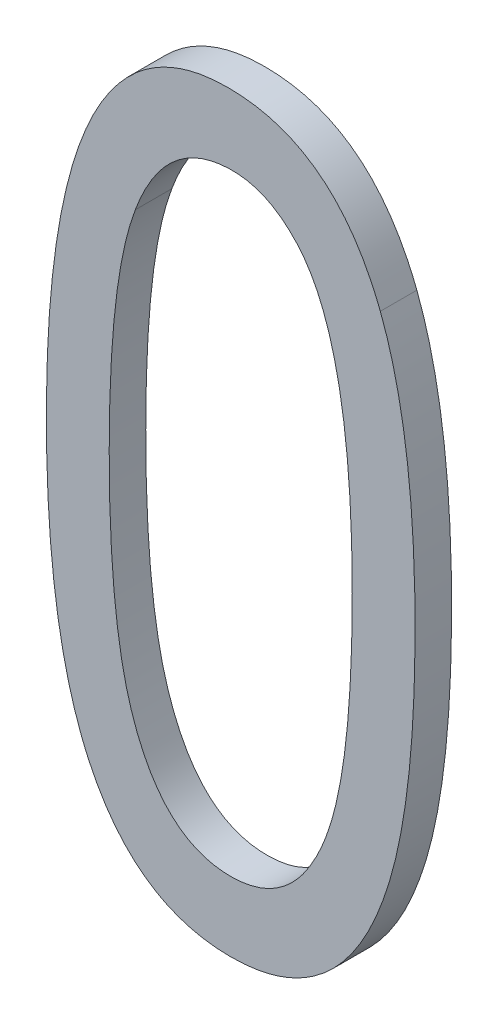
ISO-10303-21;
HEADER;
FILE_DESCRIPTION(('STEP AP214'),'2;1');
FILE_NAME('part.step','',(''),(''),'','','');
FILE_SCHEMA(('AUTOMOTIVE_DESIGN { 1 0 10303 214 1 1 1 1 }'));
ENDSEC;
DATA;
#1=APPLICATION_CONTEXT('core data for automotive mechanical design processes');
#2=APPLICATION_PROTOCOL_DEFINITION('international standard','automotive_design',2000,#1);
#3=PRODUCT_CONTEXT('',#1,'mechanical');
#4=PRODUCT('Part','Part','',(#3));
#5=PRODUCT_RELATED_PRODUCT_CATEGORY('part','',(#4));
#6=PRODUCT_DEFINITION_FORMATION('','',#4);
#7=PRODUCT_DEFINITION_CONTEXT('part definition',#1,'design');
#8=PRODUCT_DEFINITION('design','',#6,#7);
#9=PRODUCT_DEFINITION_SHAPE('','',#8);
#10=(LENGTH_UNIT() NAMED_UNIT(*) SI_UNIT(.MILLI.,.METRE.));
#11=(NAMED_UNIT(*) PLANE_ANGLE_UNIT() SI_UNIT($,.RADIAN.));
#12=(NAMED_UNIT(*) SI_UNIT($,.STERADIAN.) SOLID_ANGLE_UNIT());
#13=UNCERTAINTY_MEASURE_WITH_UNIT(LENGTH_MEASURE(1.E-05),#10,'distance_accuracy_value','');
#14=(GEOMETRIC_REPRESENTATION_CONTEXT(3) GLOBAL_UNCERTAINTY_ASSIGNED_CONTEXT((#13)) GLOBAL_UNIT_ASSIGNED_CONTEXT((#10,
#11,#12)) REPRESENTATION_CONTEXT('',''));
#15=CARTESIAN_POINT('',(0.,0.,0.));
#16=DIRECTION('',(0.,0.,1.));
#17=DIRECTION('',(1.,0.,0.));
#18=AXIS2_PLACEMENT_3D('',#15,#16,#17);
#19=CARTESIAN_POINT('',(178.017928916616,131.090958591415,-38.9997200126349));
#20=DIRECTION('',(0.,0.,-1.));
#21=DIRECTION('',(-1.,0.,0.));
#22=AXIS2_PLACEMENT_3D('',#19,#20,#21);
#23=PLANE('',#22);
#24=CARTESIAN_POINT('',(178.099742593529,130.864264361799,-38.9997200126349));
#25=CARTESIAN_POINT('',(178.093789580297,130.848475242088,-38.9997200126349));
#26=CARTESIAN_POINT('',(178.08852315684,130.832454429874,-38.9997200126349));
#27=CARTESIAN_POINT('',(178.079088888856,130.800117533578,-38.9997200126349));
#28=CARTESIAN_POINT('',(178.074919252059,130.783801978365,-38.9997200126349));
#29=CARTESIAN_POINT('',(178.063624682335,130.73460686473,-38.9997200126349));
#30=CARTESIAN_POINT('',(178.057707016121,130.701457754597,-38.9997200126349));
#31=CARTESIAN_POINT('',(178.046305345,130.623785000683,-38.9997200126349));
#32=CARTESIAN_POINT('',(178.041623235214,130.579152646366,-38.9997200126349));
#33=CARTESIAN_POINT('',(178.034580919529,130.489674358544,-38.9997200126349));
#34=CARTESIAN_POINT('',(178.03222324867,130.444828245335,-38.9997200126349));
#35=CARTESIAN_POINT('',(178.029158189313,130.355024379923,-38.9997200126349));
#36=CARTESIAN_POINT('',(178.02845307034,130.310066558975,-38.9997200126349));
#37=CARTESIAN_POINT('',(178.028241692854,130.219951978565,-38.9997200126349));
#38=CARTESIAN_POINT('',(178.028740700059,130.174795210433,-38.9997200126349));
#39=CARTESIAN_POINT('',(178.031279086931,130.084581394692,-38.9997200126349));
#40=CARTESIAN_POINT('',(178.033316354461,130.039524295235,-38.9997200126349));
#41=CARTESIAN_POINT('',(178.039559584174,129.949595568297,-38.9997200126349));
#42=CARTESIAN_POINT('',(178.043763168341,129.904723791713,-38.9997200126349));
#43=CARTESIAN_POINT('',(178.054199933482,129.825658047955,-38.9997200126349));
#44=CARTESIAN_POINT('',(178.059744386184,129.791380774313,-38.9997200126349));
#45=CARTESIAN_POINT('',(178.07042809382,129.740489065222,-38.9997200126349));
#46=CARTESIAN_POINT('',(178.074378001212,129.723631408122,-38.9997200126349));
#47=CARTESIAN_POINT('',(178.083390155911,129.690216726647,-38.9997200126349));
#48=CARTESIAN_POINT('',(178.088452220159,129.673659653281,-38.9997200126349));
#49=CARTESIAN_POINT('',(178.101853487938,129.634573217558,-38.9997200126349));
#50=CARTESIAN_POINT('',(178.110702566416,129.612214848004,-38.9997200126349));
#51=CARTESIAN_POINT('',(178.131297470756,129.568817174476,-38.9997200126349));
#52=CARTESIAN_POINT('',(178.143040364867,129.547776562361,-38.9997200126349));
#53=CARTESIAN_POINT('',(178.165130846547,129.515886492571,-38.9997200126349));
#54=CARTESIAN_POINT('',(178.174287075146,129.504222752655,-38.9997200126349));
#55=CARTESIAN_POINT('',(178.194242826507,129.48241448985,-38.9997200126349));
#56=CARTESIAN_POINT('',(178.205038122106,129.472266188477,-38.9997200126349));
#57=CARTESIAN_POINT('',(178.228469151742,129.453957194679,-38.9997200126349));
#58=CARTESIAN_POINT('',(178.241127871571,129.445825341317,-38.9997200126349));
#59=CARTESIAN_POINT('',(178.267842018079,129.432320424252,-38.9997200126349));
#60=CARTESIAN_POINT('',(178.281896383116,129.42694528247,-38.9997200126349));
#61=CARTESIAN_POINT('',(178.308504980075,129.419746445154,-38.9997200126349));
#62=CARTESIAN_POINT('',(178.32094831269,129.417497668166,-38.9997200126349));
#63=CARTESIAN_POINT('',(178.346048686785,129.414881213968,-38.9997200126349));
#64=CARTESIAN_POINT('',(178.358706184486,129.414518250076,-38.9997200126349));
#65=CARTESIAN_POINT('',(178.385373559208,129.415602311855,-38.9997200126349));
#66=CARTESIAN_POINT('',(178.399376481428,129.417256156512,-38.9997200126349));
#67=CARTESIAN_POINT('',(178.426815030118,129.42310198542,-38.9997200126349));
#68=CARTESIAN_POINT('',(178.44025242501,129.427285312832,-38.9997200126349));
#69=CARTESIAN_POINT('',(178.465340877674,129.437840719023,-38.9997200126349));
#70=CARTESIAN_POINT('',(178.477049988509,129.444075574264,-38.9997200126349));
#71=CARTESIAN_POINT('',(178.499228407166,129.458467642927,-38.9997200126349));
#72=CARTESIAN_POINT('',(178.509695812353,129.466627750615,-38.9997200126349));
#73=CARTESIAN_POINT('',(178.532582368561,129.487422160129,-38.9997200126349));
#74=CARTESIAN_POINT('',(178.54446824061,129.500637077797,-38.9997200126349));
#75=CARTESIAN_POINT('',(178.566072937179,129.528773580962,-38.9997200126349));
#76=CARTESIAN_POINT('',(178.575781449243,129.543702801898,-38.9997200126349));
#77=CARTESIAN_POINT('',(178.592018384167,129.572180061341,-38.9997200126349));
#78=CARTESIAN_POINT('',(178.598806423218,129.585584456034,-38.9997200126349));
#79=CARTESIAN_POINT('',(178.611227439196,129.612729594924,-38.9997200126349));
#80=CARTESIAN_POINT('',(178.616873181887,129.626464450378,-38.9997200126349));
#81=CARTESIAN_POINT('',(178.622096790767,129.640336357564,-38.9997200126349));
#82=B_SPLINE_CURVE_WITH_KNOTS('',3,(#24,#25,#26,#27,#28,#29,#30,#31,#32,#33,#34,#35,#36,#37,#38,
#39,#40,#41,#42,#43,#44,#45,#46,#47,#48,#49,#50,#51,#52,#53,#54,#55,#56,#57,#58,#59,#60,#61,#62,
#63,#64,#65,#66,#67,#68,#69,#70,#71,#72,#73,#74,#75,#76,#77,#78,#79,#80,#81),.UNSPECIFIED.,.F.,
.F.,(4,2,2,2,2,2,2,2,2,2,2,2,2,2,2,2,2,2,2,2,2,2,2,2,2,2,2,2,4),(0.,0.0505697521013727,
0.101056346901998,0.201963135015351,0.336501437363886,0.471186305792561,0.606056034920357,
0.741516625664493,0.876791557203466,1.01191830958986,1.11598120562329,1.16789468256168,
1.21979962096612,1.29181096162124,1.36374964472859,1.40810546546208,1.45234877662432,
1.49719243924349,1.54200224770691,1.57977700606854,1.6176461316995,1.65974753133217,
1.70170565331121,1.74128991218939,1.7809340622713,1.83395571191186,1.88722341591341,
1.93225019029301,1.97674197173791),.UNSPECIFIED.);
#83=CARTESIAN_POINT('',(178.099742593529,130.864264361799,-38.9997200126349));
#84=VERTEX_POINT('',#83);
#85=CARTESIAN_POINT('',(178.622096790767,129.640336357564,-38.9997200126349));
#86=VERTEX_POINT('',#85);
#87=EDGE_CURVE('E82',#84,#86,#82,.T.);
#88=ORIENTED_EDGE('',*,*,#87,.F.);
#89=CARTESIAN_POINT('',(178.622096790767,129.640336357564,-38.9997200126349));
#90=CARTESIAN_POINT('',(178.628004330679,129.656132944584,-38.9997200126349));
#91=CARTESIAN_POINT('',(178.633238789312,129.672155401784,-38.9997200126349));
#92=CARTESIAN_POINT('',(178.642627417429,129.70448939799,-38.9997200126349));
#93=CARTESIAN_POINT('',(178.646783301055,129.720800433742,-38.9997200126349));
#94=CARTESIAN_POINT('',(178.658052383211,129.769988651637,-38.9997200126349));
#95=CARTESIAN_POINT('',(178.663970804411,129.803132311392,-38.9997200126349));
#96=CARTESIAN_POINT('',(178.675392805247,129.880830542612,-38.9997200126349));
#97=CARTESIAN_POINT('',(178.680095574965,129.925494025505,-38.9997200126349));
#98=CARTESIAN_POINT('',(178.687175099144,130.015036056765,-38.9997200126349));
#99=CARTESIAN_POINT('',(178.689549296494,130.059914787302,-38.9997200126349));
#100=CARTESIAN_POINT('',(178.69265463705,130.149785676277,-38.9997200126349));
#101=CARTESIAN_POINT('',(178.693383474428,130.194777905545,-38.9997200126349));
#102=CARTESIAN_POINT('',(178.693594441821,130.284934462767,-38.9997200126349));
#103=CARTESIAN_POINT('',(178.693071882023,130.330098802803,-38.9997200126349));
#104=CARTESIAN_POINT('',(178.69033528282,130.420316878215,-38.9997200126349));
#105=CARTESIAN_POINT('',(178.688123705049,130.465370678913,-38.9997200126349));
#106=CARTESIAN_POINT('',(178.681422476828,130.55526623786,-38.9997200126349));
#107=CARTESIAN_POINT('',(178.676935681316,130.600108190934,-38.9997200126349));
#108=CARTESIAN_POINT('',(178.666042042627,130.679049407534,-38.9997200126349));
#109=CARTESIAN_POINT('',(178.6603183625,130.713236890861,-38.9997200126349));
#110=CARTESIAN_POINT('',(178.649583947967,130.764062587247,-38.9997200126349));
#111=CARTESIAN_POINT('',(178.645648755054,130.78092493017,-38.9997200126349));
#112=CARTESIAN_POINT('',(178.636886658911,130.814407870121,-38.9997200126349));
#113=CARTESIAN_POINT('',(178.632060155139,130.831028571859,-38.9997200126349));
#114=CARTESIAN_POINT('',(178.619489638825,130.869406441959,-38.9997200126349));
#115=CARTESIAN_POINT('',(178.611309330132,130.891030440105,-38.9997200126349));
#116=CARTESIAN_POINT('',(178.596939273923,130.922480718343,-38.9997200126349));
#117=CARTESIAN_POINT('',(178.591806282151,130.932788799311,-38.9997200126349));
#118=CARTESIAN_POINT('',(178.580700785858,130.952936420333,-38.9997200126349));
#119=CARTESIAN_POINT('',(178.574729298109,130.962776508817,-38.9997200126349));
#120=CARTESIAN_POINT('',(178.563764405771,130.978844704911,-38.9997200126349));
#121=CARTESIAN_POINT('',(178.559035784295,130.985252237368,-38.9997200126349));
#122=CARTESIAN_POINT('',(178.549070900974,130.997659499494,-38.9997200126349));
#123=CARTESIAN_POINT('',(178.543834370338,131.003659010346,-38.9997200126349));
#124=CARTESIAN_POINT('',(178.527521053443,131.021119267774,-38.9997200126349));
#125=CARTESIAN_POINT('',(178.515841281945,131.032040695328,-38.9997200126349));
#126=CARTESIAN_POINT('',(178.493127603276,131.049727698336,-38.9997200126349));
#127=CARTESIAN_POINT('',(178.482405268834,131.056888521978,-38.9997200126349));
#128=CARTESIAN_POINT('',(178.459945231836,131.069305733308,-38.9997200126349));
#129=CARTESIAN_POINT('',(178.448211381583,131.074568982478,-38.9997200126349));
#130=CARTESIAN_POINT('',(178.423923323605,131.082900861981,-38.9997200126349));
#131=CARTESIAN_POINT('',(178.411365931425,131.08596034952,-38.9997200126349));
#132=CARTESIAN_POINT('',(178.392267173485,131.088835338516,-38.9997200126349));
#133=CARTESIAN_POINT('',(178.385842898512,131.089507543054,-38.9997200126349));
#134=CARTESIAN_POINT('',(178.37295891898,131.090279576979,-38.9997200126349));
#135=CARTESIAN_POINT('',(178.366499199154,131.090379136528,-38.9997200126349));
#136=CARTESIAN_POINT('',(178.347681275993,131.090023396089,-38.9997200126349));
#137=CARTESIAN_POINT('',(178.335328633246,131.088977739146,-38.9997200126349));
#138=CARTESIAN_POINT('',(178.31093476444,131.085060073216,-38.9997200126349));
#139=CARTESIAN_POINT('',(178.298892948332,131.08219183763,-38.9997200126349));
#140=CARTESIAN_POINT('',(178.27372096669,131.07397811753,-38.9997200126349));
#141=CARTESIAN_POINT('',(178.260686235486,131.068333691532,-38.9997200126349));
#142=CARTESIAN_POINT('',(178.235898574001,131.054729287914,-38.9997200126349));
#143=CARTESIAN_POINT('',(178.22414588503,131.046768875404,-38.9997200126349));
#144=CARTESIAN_POINT('',(178.200284410746,131.027490389244,-38.9997200126349));
#145=CARTESIAN_POINT('',(178.188454101761,131.015831683925,-38.9997200126349));
#146=CARTESIAN_POINT('',(178.166764165821,130.99073318987,-38.9997200126349));
#147=CARTESIAN_POINT('',(178.156916435369,130.97728340953,-38.9997200126349));
#148=CARTESIAN_POINT('',(178.137948683689,130.94767383249,-38.9997200126349));
#149=CARTESIAN_POINT('',(178.12904317893,130.931380333798,-38.9997200126349));
#150=CARTESIAN_POINT('',(178.113136679815,130.898196417025,-38.9997200126349));
#151=CARTESIAN_POINT('',(178.106107674956,130.881319595501,-38.9997200126349));
#152=CARTESIAN_POINT('',(178.099742593529,130.864264361799,-38.9997200126349));
#153=B_SPLINE_CURVE_WITH_KNOTS('',3,(#89,#90,#91,#92,#93,#94,#95,#96,#97,#98,#99,#100,#101,#102,
#103,#104,#105,#106,#107,#108,#109,#110,#111,#112,#113,#114,#115,#116,#117,#118,#119,#120,#121,
#122,#123,#124,#125,#126,#127,#128,#129,#130,#131,#132,#133,#134,#135,#136,#137,#138,#139,#140,
#141,#142,#143,#144,#145,#146,#147,#148,#149,#150,#151,#152),.UNSPECIFIED.,.F.,.F.,(4,2,2,2,2,2,
2,2,2,2,2,2,2,2,2,2,2,2,2,2,2,2,2,2,2,2,2,2,2,2,2,4),(0.,0.0505451263480618,0.10100942424803,
0.201902267541754,0.336539886851855,0.471325192870312,0.606299271702933,0.741779978745484,
0.877063607287347,1.01217790073848,1.11607361424904,1.16799878628334,1.21990074317902,
1.28909095466446,1.32360838480785,1.35808431440848,1.38194736016653,1.40582310408427,
1.45357840362623,1.49210254296712,1.53048595084576,1.5690276977165,1.58838285091999,
1.60774712377259,1.64481149010122,1.68179936861825,1.72415150207021,1.76651159345748,
1.81606544779546,1.86590832630615,1.92149301694758,1.97619459018601),.UNSPECIFIED.);
#154=EDGE_CURVE('E80',#86,#84,#153,.T.);
#155=ORIENTED_EDGE('',*,*,#154,.F.);
#156=EDGE_LOOP('',(#88,#155));
#157=FACE_BOUND('',#156,.T.);
#158=CARTESIAN_POINT('',(178.770342929953,130.959023493615,-38.9997200126349));
#159=CARTESIAN_POINT('',(178.776383739973,130.943337899789,-38.9997200126349));
#160=CARTESIAN_POINT('',(178.781965480448,130.927484629563,-38.9997200126349));
#161=CARTESIAN_POINT('',(178.792322898546,130.895528883182,-38.9997200126349));
#162=CARTESIAN_POINT('',(178.797099176502,130.879426602482,-38.9997200126349));
#163=CARTESIAN_POINT('',(178.810367962917,130.830956917848,-38.9997200126349));
#164=CARTESIAN_POINT('',(178.817842447056,130.798312063508,-38.9997200126349));
#165=CARTESIAN_POINT('',(178.832918518744,130.721440274453,-38.9997200126349));
#166=CARTESIAN_POINT('',(178.839695444558,130.677057385156,-38.9997200126349));
#167=CARTESIAN_POINT('',(178.850559937959,130.58792176834,-38.9997200126349));
#168=CARTESIAN_POINT('',(178.854643821674,130.543168618663,-38.9997200126349));
#169=CARTESIAN_POINT('',(178.860753484742,130.453478301139,-38.9997200126349));
#170=CARTESIAN_POINT('',(178.862776931202,130.408540982415,-38.9997200126349));
#171=CARTESIAN_POINT('',(178.865217909472,130.31823868764,-38.9997200126349));
#172=CARTESIAN_POINT('',(178.865621391394,130.272873376238,-38.9997200126349));
#173=CARTESIAN_POINT('',(178.865063783104,130.182200324324,-38.9997200126349));
#174=CARTESIAN_POINT('',(178.864104181516,130.136892575012,-38.9997200126349));
#175=CARTESIAN_POINT('',(178.86042279168,130.046367839625,-38.9997200126349));
#176=CARTESIAN_POINT('',(178.857702069792,130.001150815226,-38.9997200126349));
#177=CARTESIAN_POINT('',(178.850949300178,129.922382201833,-38.9997200126349));
#178=CARTESIAN_POINT('',(178.847426593543,129.888787897993,-38.9997200126349));
#179=CARTESIAN_POINT('',(178.838767684882,129.82181056423,-38.9997200126349));
#180=CARTESIAN_POINT('',(178.833631902534,129.788427481655,-38.9997200126349));
#181=CARTESIAN_POINT('',(178.821343966004,129.72227678713,-38.9997200126349));
#182=CARTESIAN_POINT('',(178.814207051765,129.689506446587,-38.9997200126349));
#183=CARTESIAN_POINT('',(178.797156203846,129.624710527528,-38.9997200126349));
#184=CARTESIAN_POINT('',(178.78724537636,129.592684159116,-38.9997200126349));
#185=CARTESIAN_POINT('',(178.766020008948,129.535077142579,-38.9997200126349));
#186=CARTESIAN_POINT('',(178.755214445246,129.509311580616,-38.9997200126349));
#187=CARTESIAN_POINT('',(178.73069433483,129.4590920697,-38.9997200126349));
#188=CARTESIAN_POINT('',(178.716973218722,129.434641241708,-38.9997200126349));
#189=CARTESIAN_POINT('',(178.685777814598,129.387668977202,-38.9997200126349));
#190=CARTESIAN_POINT('',(178.668251006054,129.36518143479,-38.9997200126349));
#191=CARTESIAN_POINT('',(178.629168301156,129.324076248212,-38.9997200126349));
#192=CARTESIAN_POINT('',(178.607630267014,129.305442191969,-38.9997200126349));
#193=CARTESIAN_POINT('',(178.566987812115,129.277732791769,-38.9997200126349));
#194=CARTESIAN_POINT('',(178.548716427189,129.26743201411,-38.9997200126349));
#195=CARTESIAN_POINT('',(178.510662797142,129.2501474644,-38.9997200126349));
#196=CARTESIAN_POINT('',(178.490880362769,129.243164108632,-38.9997200126349));
#197=CARTESIAN_POINT('',(178.450585677218,129.232565499357,-38.9997200126349));
#198=CARTESIAN_POINT('',(178.430078752501,129.22892949367,-38.9997200126349));
#199=CARTESIAN_POINT('',(178.388727760525,129.224560184324,-38.9997200126349));
#200=CARTESIAN_POINT('',(178.367882899491,129.223835176074,-38.9997200126349));
#201=CARTESIAN_POINT('',(178.322367263294,129.225126635684,-38.9997200126349));
#202=CARTESIAN_POINT('',(178.297706823728,129.227678718281,-38.9997200126349));
#203=CARTESIAN_POINT('',(178.249326427406,129.237298330561,-38.9997200126349));
#204=CARTESIAN_POINT('',(178.225603267389,129.244348751809,-38.9997200126349));
#205=CARTESIAN_POINT('',(178.181571104982,129.262500665746,-38.9997200126349));
#206=CARTESIAN_POINT('',(178.161140205607,129.273305776927,-38.9997200126349));
#207=CARTESIAN_POINT('',(178.122649582816,129.29855698438,-38.9997200126349));
#208=CARTESIAN_POINT('',(178.104593282447,129.313008251029,-38.9997200126349));
#209=CARTESIAN_POINT('',(178.068163035866,129.347562151279,-38.9997200126349));
#210=CARTESIAN_POINT('',(178.05031709108,129.368213821031,-38.9997200126349));
#211=CARTESIAN_POINT('',(178.018103496427,129.412100721718,-38.9997200126349));
#212=CARTESIAN_POINT('',(178.003746842245,129.4353437916,-38.9997200126349));
#213=CARTESIAN_POINT('',(177.983350359737,129.473421924732,-38.9997200126349));
#214=CARTESIAN_POINT('',(177.976329131139,129.487750819333,-38.9997200126349));
#215=CARTESIAN_POINT('',(177.963245364639,129.516708809978,-38.9997200126349));
#216=CARTESIAN_POINT('',(177.957175865547,129.531334747628,-38.9997200126349));
#217=CARTESIAN_POINT('',(177.951496454343,129.546106606373,-38.9997200126349));
#218=B_SPLINE_CURVE_WITH_KNOTS('',3,(#158,#159,#160,#161,#162,#163,#164,#165,#166,#167,#168,
#169,#170,#171,#172,#173,#174,#175,#176,#177,#178,#179,#180,#181,#182,#183,#184,#185,#186,#187,
#188,#189,#190,#191,#192,#193,#194,#195,#196,#197,#198,#199,#200,#201,#202,#203,#204,#205,#206,
#207,#208,#209,#210,#211,#212,#213,#214,#215,#216,#217),.UNSPECIFIED.,.F.,.F.,(4,2,2,2,2,2,2,2,
2,2,2,2,2,2,2,2,2,2,2,2,2,2,2,2,2,2,2,2,2,4),(0.,0.0504059167911297,0.100774096965071,
0.201145630119258,0.335720898441056,0.470479875519744,0.605391261949291,0.741470234259192,
0.877400708844989,1.01324895426816,1.1145547233317,1.21583415718673,1.31636230542956,
1.41677833076491,1.50046425327396,1.58434077728174,1.66945814898847,1.75420517810563,
1.81682345639526,1.8794495901967,1.94168480070983,2.0040972362863,2.07813118924435,
2.15188523539914,2.22079670750334,2.28980645318114,2.37123966682029,2.45292626433539,
2.5007696459017,2.54824488311769),.UNSPECIFIED.);
#219=CARTESIAN_POINT('',(178.770342929953,130.959023493615,-38.9997200126349));
#220=VERTEX_POINT('',#219);
#221=CARTESIAN_POINT('',(177.951496454343,129.546106606373,-38.9997200126349));
#222=VERTEX_POINT('',#221);
#223=EDGE_CURVE('E67',#220,#222,#218,.T.);
#224=ORIENTED_EDGE('',*,*,#223,.F.);
#225=CARTESIAN_POINT('',(177.951496454343,129.546106606373,-38.9997200126349));
#226=CARTESIAN_POINT('',(177.945474034493,129.561795160987,-38.9997200126349));
#227=CARTESIAN_POINT('',(177.939908974517,129.577650211671,-38.9997200126349));
#228=CARTESIAN_POINT('',(177.929581309168,129.609607705384,-38.9997200126349));
#229=CARTESIAN_POINT('',(177.924818111387,129.625709956103,-38.9997200126349));
#230=CARTESIAN_POINT('',(177.911579945175,129.674188332918,-38.9997200126349));
#231=CARTESIAN_POINT('',(177.904118436622,129.706839972945,-38.9997200126349));
#232=CARTESIAN_POINT('',(177.88905831944,129.783735601387,-38.9997200126349));
#233=CARTESIAN_POINT('',(177.882281098254,129.828134722178,-38.9997200126349));
#234=CARTESIAN_POINT('',(177.871403544211,129.917301531891,-38.9997200126349));
#235=CARTESIAN_POINT('',(177.867306852366,129.962069638832,-38.9997200126349));
#236=CARTESIAN_POINT('',(177.861170644387,130.051791461034,-38.9997200126349));
#237=CARTESIAN_POINT('',(177.85913351981,130.096745331349,-38.9997200126349));
#238=CARTESIAN_POINT('',(177.856644682673,130.187059318706,-38.9997200126349));
#239=CARTESIAN_POINT('',(177.856206039548,130.232419758082,-38.9997200126349));
#240=CARTESIAN_POINT('',(177.856775973282,130.323081419516,-38.9997200126349));
#241=CARTESIAN_POINT('',(177.857782909591,130.368382650395,-38.9997200126349));
#242=CARTESIAN_POINT('',(177.861656931768,130.458883307037,-38.9997200126349));
#243=CARTESIAN_POINT('',(177.864522757926,130.504082780957,-38.9997200126349));
#244=CARTESIAN_POINT('',(177.871573549321,130.582772903081,-38.9997200126349));
#245=CARTESIAN_POINT('',(177.875235667544,130.61630973198,-38.9997200126349));
#246=CARTESIAN_POINT('',(177.884164395487,130.683192935084,-38.9997200126349));
#247=CARTESIAN_POINT('',(177.889431818133,130.716539204053,-38.9997200126349));
#248=CARTESIAN_POINT('',(177.901924156887,130.782623358916,-38.9997200126349));
#249=CARTESIAN_POINT('',(177.909134728225,130.815363895091,-38.9997200126349));
#250=CARTESIAN_POINT('',(177.926067343046,130.880176210977,-38.9997200126349));
#251=CARTESIAN_POINT('',(177.935786771319,130.912248649708,-38.9997200126349));
#252=CARTESIAN_POINT('',(177.956500194302,130.969686770112,-38.9997200126349));
#253=CARTESIAN_POINT('',(177.966968070338,130.995238656133,-38.9997200126349));
#254=CARTESIAN_POINT('',(177.990716880512,131.045101119168,-38.9997200126349));
#255=CARTESIAN_POINT('',(178.004003601451,131.06940901299,-38.9997200126349));
#256=CARTESIAN_POINT('',(178.03423718281,131.116209985718,-38.9997200126349));
#257=CARTESIAN_POINT('',(178.051235165444,131.13867098759,-38.9997200126349));
#258=CARTESIAN_POINT('',(178.089242078127,131.179869534896,-38.9997200126349));
#259=CARTESIAN_POINT('',(178.110234025597,131.198622183657,-38.9997200126349));
#260=CARTESIAN_POINT('',(178.149625098837,131.226346206265,-38.9997200126349));
#261=CARTESIAN_POINT('',(178.167131335623,131.236588093705,-38.9997200126349));
#262=CARTESIAN_POINT('',(178.203647500228,131.253879556555,-38.9997200126349));
#263=CARTESIAN_POINT('',(178.222656706512,131.260930652977,-38.9997200126349));
#264=CARTESIAN_POINT('',(178.261458176303,131.271769630551,-38.9997200126349));
#265=CARTESIAN_POINT('',(178.281245671755,131.275574879839,-38.9997200126349));
#266=CARTESIAN_POINT('',(178.321192700274,131.280263216907,-38.9997200126349));
#267=CARTESIAN_POINT('',(178.341353173148,131.281137483228,-38.9997200126349));
#268=CARTESIAN_POINT('',(178.384979199733,131.280450944094,-38.9997200126349));
#269=CARTESIAN_POINT('',(178.408439231385,131.278462935197,-38.9997200126349));
#270=CARTESIAN_POINT('',(178.454690600132,131.270679483559,-38.9997200126349));
#271=CARTESIAN_POINT('',(178.4774836122,131.264894621776,-38.9997200126349));
#272=CARTESIAN_POINT('',(178.522634078207,131.248845032742,-38.9997200126349));
#273=CARTESIAN_POINT('',(178.544924742814,131.238388787963,-38.9997200126349));
#274=CARTESIAN_POINT('',(178.587005398151,131.213282781824,-38.9997200126349));
#275=CARTESIAN_POINT('',(178.606793829666,131.198630424126,-38.9997200126349));
#276=CARTESIAN_POINT('',(178.644917208318,131.164661710575,-38.9997200126349));
#277=CARTESIAN_POINT('',(178.662991796877,131.145057595333,-38.9997200126349));
#278=CARTESIAN_POINT('',(178.695786345031,131.103166812801,-38.9997200126349));
#279=CARTESIAN_POINT('',(178.710493863726,131.080870647637,-38.9997200126349));
#280=CARTESIAN_POINT('',(178.732804702228,131.041866957109,-38.9997200126349));
#281=CARTESIAN_POINT('',(178.741191326622,131.025592244302,-38.9997200126349));
#282=CARTESIAN_POINT('',(178.756665289878,130.992612642449,-38.9997200126349));
#283=CARTESIAN_POINT('',(178.763763683187,130.975912968578,-38.9997200126349));
#284=CARTESIAN_POINT('',(178.770342929953,130.959023493615,-38.9997200126349));
#285=B_SPLINE_CURVE_WITH_KNOTS('',3,(#225,#226,#227,#228,#229,#230,#231,#232,#233,#234,#235,
#236,#237,#238,#239,#240,#241,#242,#243,#244,#245,#246,#247,#248,#249,#250,#251,#252,#253,#254,
#255,#256,#257,#258,#259,#260,#261,#262,#263,#264,#265,#266,#267,#268,#269,#270,#271,#272,#273,
#274,#275,#276,#277,#278,#279,#280,#281,#282,#283,#284),.UNSPECIFIED.,.F.,.F.,(4,2,2,2,2,2,2,2,
2,2,2,2,2,2,2,2,2,2,2,2,2,2,2,2,2,2,2,2,2,4),(0.,0.0503945271737126,0.10075165846432,
0.201135330613666,0.335760109523949,0.470567374183789,0.605530997154564,0.74159565902597,
0.877506026763421,1.01332438845358,1.11450339241072,1.21573371874453,1.31623629432947,
1.41663452701319,1.49934715414905,1.58223125397113,1.66633854986945,1.75009590114861,
1.81064867143646,1.8711725464565,1.93137049679814,1.99174946468815,2.06212675165376,
2.13230874124568,2.20567797210259,2.27909269851209,2.35865332061552,2.43850332819713,
2.4933820173032,2.54776487684637),.UNSPECIFIED.);
#286=EDGE_CURVE('E24',#222,#220,#285,.T.);
#287=ORIENTED_EDGE('',*,*,#286,.F.);
#288=EDGE_LOOP('',(#224,#287));
#289=FACE_BOUND('',#288,.T.);
#290=ADVANCED_FACE('F17',(#157,#289),#23,.F.);
#291=CARTESIAN_POINT('',(178.770342929953,130.959023493615,-39.0997200126349));
#292=CARTESIAN_POINT('',(178.770342929953,130.959023493615,-38.9997200126349));
#293=CARTESIAN_POINT('',(178.686905966799,131.173422646606,-39.0997200126349));
#294=CARTESIAN_POINT('',(178.686905966799,131.173422646606,-38.9997200126349));
#295=CARTESIAN_POINT('',(178.547585642275,131.280886913413,-39.0997200126349));
#296=CARTESIAN_POINT('',(178.547585642275,131.280886913413,-38.9997200126349));
#297=CARTESIAN_POINT('',(178.02212681385,131.280886913413,-39.0997200126349));
#298=CARTESIAN_POINT('',(178.02212681385,131.280886913413,-38.9997200126349));
#299=CARTESIAN_POINT('',(177.856417124236,130.938377649253,-39.0997200126349));
#300=CARTESIAN_POINT('',(177.856417124236,130.938377649253,-38.9997200126349));
#301=CARTESIAN_POINT('',(177.856417124236,129.946318358623,-39.0997200126349));
#302=CARTESIAN_POINT('',(177.856417124236,129.946318358623,-38.9997200126349));
#303=CARTESIAN_POINT('',(177.888239593905,129.710743980645,-39.0997200126349));
#304=CARTESIAN_POINT('',(177.888239593905,129.710743980645,-38.9997200126349));
#305=CARTESIAN_POINT('',(177.951496454343,129.546106606373,-39.0997200126349));
#306=CARTESIAN_POINT('',(177.951496454343,129.546106606373,-38.9997200126349));
#307=B_SPLINE_SURFACE_WITH_KNOTS('',3,1,((#291,#292),(#293,#294),(#295,#296),(#297,#298),(#299,
#300),(#301,#302),(#303,#304),(#305,#306)),.UNSPECIFIED.,.F.,.F.,.F.,(4,2,2,4),(2,2),(0.,
0.288697589169659,0.78023260625893,1.),(1.,1.09999999999999),.UNSPECIFIED.);
#308=CARTESIAN_POINT('',(177.951496454343,129.546106606373,-39.0997200126349));
#309=CARTESIAN_POINT('',(177.945474034493,129.561795160987,-39.0997200126349));
#310=CARTESIAN_POINT('',(177.939908974517,129.577650211671,-39.0997200126349));
#311=CARTESIAN_POINT('',(177.929581309168,129.609607705384,-39.0997200126349));
#312=CARTESIAN_POINT('',(177.924818111387,129.625709956103,-39.0997200126349));
#313=CARTESIAN_POINT('',(177.911579945175,129.674188332918,-39.0997200126349));
#314=CARTESIAN_POINT('',(177.904118436622,129.706839972945,-39.0997200126349));
#315=CARTESIAN_POINT('',(177.88905831944,129.783735601387,-39.0997200126349));
#316=CARTESIAN_POINT('',(177.882281098254,129.828134722178,-39.0997200126349));
#317=CARTESIAN_POINT('',(177.871403544211,129.917301531891,-39.0997200126349));
#318=CARTESIAN_POINT('',(177.867306852366,129.962069638832,-39.0997200126349));
#319=CARTESIAN_POINT('',(177.861170644387,130.051791461034,-39.0997200126349));
#320=CARTESIAN_POINT('',(177.85913351981,130.096745331349,-39.0997200126349));
#321=CARTESIAN_POINT('',(177.856644682673,130.187059318706,-39.0997200126349));
#322=CARTESIAN_POINT('',(177.856206039548,130.232419758082,-39.0997200126349));
#323=CARTESIAN_POINT('',(177.856775973282,130.323081419516,-39.0997200126349));
#324=CARTESIAN_POINT('',(177.857782909591,130.368382650395,-39.0997200126349));
#325=CARTESIAN_POINT('',(177.861656931768,130.458883307037,-39.0997200126349));
#326=CARTESIAN_POINT('',(177.864522757926,130.504082780957,-39.0997200126349));
#327=CARTESIAN_POINT('',(177.871573549321,130.582772903081,-39.0997200126349));
#328=CARTESIAN_POINT('',(177.875235667544,130.61630973198,-39.0997200126349));
#329=CARTESIAN_POINT('',(177.884164395487,130.683192935084,-39.0997200126349));
#330=CARTESIAN_POINT('',(177.889431818133,130.716539204053,-39.0997200126349));
#331=CARTESIAN_POINT('',(177.901924156887,130.782623358916,-39.0997200126349));
#332=CARTESIAN_POINT('',(177.909134728225,130.815363895091,-39.0997200126349));
#333=CARTESIAN_POINT('',(177.926067343046,130.880176210977,-39.0997200126349));
#334=CARTESIAN_POINT('',(177.935786771319,130.912248649708,-39.0997200126349));
#335=CARTESIAN_POINT('',(177.956500194302,130.969686770112,-39.0997200126349));
#336=CARTESIAN_POINT('',(177.966968070338,130.995238656133,-39.0997200126349));
#337=CARTESIAN_POINT('',(177.990716880512,131.045101119168,-39.0997200126349));
#338=CARTESIAN_POINT('',(178.004003601451,131.06940901299,-39.0997200126349));
#339=CARTESIAN_POINT('',(178.034237182809,131.116209985718,-39.0997200126349));
#340=CARTESIAN_POINT('',(178.051235165444,131.13867098759,-39.0997200126349));
#341=CARTESIAN_POINT('',(178.089242078127,131.179869534896,-39.0997200126349));
#342=CARTESIAN_POINT('',(178.110234025597,131.198622183657,-39.0997200126349));
#343=CARTESIAN_POINT('',(178.149625098837,131.226346206264,-39.0997200126349));
#344=CARTESIAN_POINT('',(178.167131335623,131.236588093705,-39.0997200126349));
#345=CARTESIAN_POINT('',(178.203647500227,131.253879556555,-39.0997200126349));
#346=CARTESIAN_POINT('',(178.222656706512,131.260930652977,-39.0997200126349));
#347=CARTESIAN_POINT('',(178.261458176303,131.271769630551,-39.0997200126349));
#348=CARTESIAN_POINT('',(178.281245671755,131.275574879839,-39.0997200126349));
#349=CARTESIAN_POINT('',(178.321192700274,131.280263216907,-39.0997200126349));
#350=CARTESIAN_POINT('',(178.341353173148,131.281137483228,-39.0997200126349));
#351=CARTESIAN_POINT('',(178.384979199732,131.280450944094,-39.0997200126349));
#352=CARTESIAN_POINT('',(178.408439231385,131.278462935197,-39.0997200126349));
#353=CARTESIAN_POINT('',(178.454690600132,131.270679483559,-39.0997200126349));
#354=CARTESIAN_POINT('',(178.4774836122,131.264894621776,-39.0997200126349));
#355=CARTESIAN_POINT('',(178.522634078207,131.248845032742,-39.0997200126349));
#356=CARTESIAN_POINT('',(178.544924742814,131.238388787963,-39.0997200126349));
#357=CARTESIAN_POINT('',(178.587005398151,131.213282781825,-39.0997200126349));
#358=CARTESIAN_POINT('',(178.606793829666,131.198630424126,-39.0997200126349));
#359=CARTESIAN_POINT('',(178.644917208318,131.164661710575,-39.0997200126349));
#360=CARTESIAN_POINT('',(178.662991796876,131.145057595333,-39.0997200126349));
#361=CARTESIAN_POINT('',(178.695786345031,131.103166812801,-39.0997200126349));
#362=CARTESIAN_POINT('',(178.710493863725,131.080870647637,-39.0997200126349));
#363=CARTESIAN_POINT('',(178.732804702227,131.04186695711,-39.0997200126349));
#364=CARTESIAN_POINT('',(178.741191326622,131.025592244302,-39.0997200126349));
#365=CARTESIAN_POINT('',(178.756665289878,130.992612642449,-39.0997200126349));
#366=CARTESIAN_POINT('',(178.763763683187,130.975912968578,-39.0997200126349));
#367=CARTESIAN_POINT('',(178.770342929953,130.959023493615,-39.0997200126349));
#368=B_SPLINE_CURVE_WITH_KNOTS('',3,(#308,#309,#310,#311,#312,#313,#314,#315,#316,#317,#318,
#319,#320,#321,#322,#323,#324,#325,#326,#327,#328,#329,#330,#331,#332,#333,#334,#335,#336,#337,
#338,#339,#340,#341,#342,#343,#344,#345,#346,#347,#348,#349,#350,#351,#352,#353,#354,#355,#356,
#357,#358,#359,#360,#361,#362,#363,#364,#365,#366,#367),.UNSPECIFIED.,.F.,.F.,(4,2,2,2,2,2,2,2,
2,2,2,2,2,2,2,2,2,2,2,2,2,2,2,2,2,2,2,2,2,4),(0.,0.0503945271737296,0.100751658464326,
0.201135330613666,0.335760109523945,0.47056737418382,0.605530997154565,0.741595659025971,
0.877506026763423,1.01332438845359,1.11450339241073,1.21573371874454,1.31623629432947,
1.41663452701319,1.499347154149,1.5822312539711,1.66633854986936,1.75009590114853,
1.8106486714363,1.87117254645631,1.93137049679792,1.99174946468785,2.06212675165342,
2.13230874124539,2.20567797210231,2.27909269851175,2.35865332061491,2.43850332819626,
2.49338201730279,2.54776487684636),.UNSPECIFIED.);
#369=CARTESIAN_POINT('',(177.951496454343,129.546106606373,-39.0997200126349));
#370=VERTEX_POINT('',#369);
#371=CARTESIAN_POINT('',(178.770342929953,130.959023493615,-39.0997200126349));
#372=VERTEX_POINT('',#371);
#373=EDGE_CURVE('E111',#370,#372,#368,.T.);
#374=DIRECTION('',(0.,0.,-1.));
#375=VECTOR('',#374,1.);
#376=CARTESIAN_POINT('',(177.951496454343,129.546106606373,-39.0497200126349));
#377=LINE('',#376,#375);
#378=EDGE_CURVE('E71',#222,#370,#377,.T.);
#379=DIRECTION('',(0.,0.,1.));
#380=VECTOR('',#379,1.);
#381=CARTESIAN_POINT('',(178.770342929953,130.959023493615,-39.0497200126349));
#382=LINE('',#381,#380);
#383=EDGE_CURVE('E74',#372,#220,#382,.T.);
#384=ORIENTED_EDGE('',*,*,#373,.F.);
#385=ORIENTED_EDGE('',*,*,#378,.F.);
#386=ORIENTED_EDGE('',*,*,#286,.T.);
#387=ORIENTED_EDGE('',*,*,#383,.F.);
#388=EDGE_LOOP('',(#384,#385,#386,#387));
#389=FACE_BOUND('',#388,.T.);
#390=ADVANCED_FACE('F73',(#389),#307,.T.);
#391=CARTESIAN_POINT('',(177.951496454343,129.546106606373,-39.0997200126349));
#392=CARTESIAN_POINT('',(177.951496454343,129.546106606373,-38.9997200126349));
#393=CARTESIAN_POINT('',(178.034237395386,129.330758402497,-39.0997200126349));
#394=CARTESIAN_POINT('',(178.034237395386,129.330758402497,-38.9997200126349));
#395=CARTESIAN_POINT('',(178.171537189732,129.224243186574,-39.0997200126349));
#396=CARTESIAN_POINT('',(178.171537189732,129.224243186574,-38.9997200126349));
#397=CARTESIAN_POINT('',(178.5658253505,129.224243186574,-39.0997200126349));
#398=CARTESIAN_POINT('',(178.5658253505,129.224243186574,-38.9997200126349));
#399=CARTESIAN_POINT('',(178.709026464007,129.350235775245,-39.0997200126349));
#400=CARTESIAN_POINT('',(178.709026464007,129.350235775245,-38.9997200126349));
#401=CARTESIAN_POINT('',(178.840427883223,129.760432026344,-39.0997200126349));
#402=CARTESIAN_POINT('',(178.840427883223,129.760432026344,-38.9997200126349));
#403=CARTESIAN_POINT('',(178.86542226006,129.977551815478,-39.0997200126349));
#404=CARTESIAN_POINT('',(178.86542226006,129.977551815478,-38.9997200126349));
#405=CARTESIAN_POINT('',(178.86542226006,130.560399883239,-39.0997200126349));
#406=CARTESIAN_POINT('',(178.86542226006,130.560399883239,-38.9997200126349));
#407=CARTESIAN_POINT('',(178.833599790391,130.794915499967,-39.0997200126349));
#408=CARTESIAN_POINT('',(178.833599790391,130.794915499967,-38.9997200126349));
#409=CARTESIAN_POINT('',(178.770342929953,130.959023493615,-39.0997200126349));
#410=CARTESIAN_POINT('',(178.770342929953,130.959023493615,-38.9997200126349));
#411=B_SPLINE_SURFACE_WITH_KNOTS('',3,1,((#391,#392),(#393,#394),(#395,#396),(#397,#398),(#399,
#400),(#401,#402),(#403,#404),(#405,#406),(#407,#408),(#409,#410)),.UNSPECIFIED.,.F.,.F.,.F.,(4,
2,2,2,4),(2,2),(0.,0.283931432389945,0.59234976449322,0.785992882722147,1.),(1.,
1.09999999999999),.UNSPECIFIED.);
#412=CARTESIAN_POINT('',(178.770342929953,130.959023493615,-39.0997200126349));
#413=CARTESIAN_POINT('',(178.776383739973,130.943337899789,-39.0997200126349));
#414=CARTESIAN_POINT('',(178.781965480448,130.927484629563,-39.0997200126349));
#415=CARTESIAN_POINT('',(178.792322898546,130.895528883182,-39.0997200126349));
#416=CARTESIAN_POINT('',(178.797099176502,130.879426602482,-39.0997200126349));
#417=CARTESIAN_POINT('',(178.810367962917,130.830956917848,-39.0997200126349));
#418=CARTESIAN_POINT('',(178.817842447056,130.798312063508,-39.0997200126349));
#419=CARTESIAN_POINT('',(178.832918518744,130.721440274453,-39.0997200126349));
#420=CARTESIAN_POINT('',(178.839695444558,130.677057385156,-39.0997200126349));
#421=CARTESIAN_POINT('',(178.850559937959,130.58792176834,-39.0997200126349));
#422=CARTESIAN_POINT('',(178.854643821674,130.543168618663,-39.0997200126349));
#423=CARTESIAN_POINT('',(178.860753484742,130.453478301139,-39.0997200126349));
#424=CARTESIAN_POINT('',(178.862776931202,130.408540982415,-39.0997200126349));
#425=CARTESIAN_POINT('',(178.865217909472,130.31823868764,-39.0997200126349));
#426=CARTESIAN_POINT('',(178.865621391394,130.272873376238,-39.0997200126349));
#427=CARTESIAN_POINT('',(178.865063783104,130.182200324324,-39.0997200126349));
#428=CARTESIAN_POINT('',(178.864104181516,130.136892575012,-39.0997200126349));
#429=CARTESIAN_POINT('',(178.86042279168,130.046367839625,-39.0997200126349));
#430=CARTESIAN_POINT('',(178.857702069792,130.001150815226,-39.0997200126349));
#431=CARTESIAN_POINT('',(178.850949300178,129.922382201833,-39.0997200126349));
#432=CARTESIAN_POINT('',(178.847426593543,129.888787897993,-39.0997200126349));
#433=CARTESIAN_POINT('',(178.838767684882,129.82181056423,-39.0997200126349));
#434=CARTESIAN_POINT('',(178.833631902534,129.788427481655,-39.0997200126349));
#435=CARTESIAN_POINT('',(178.821343966004,129.72227678713,-39.0997200126349));
#436=CARTESIAN_POINT('',(178.814207051765,129.689506446587,-39.0997200126349));
#437=CARTESIAN_POINT('',(178.797156203846,129.624710527528,-39.0997200126349));
#438=CARTESIAN_POINT('',(178.78724537636,129.592684159116,-39.0997200126349));
#439=CARTESIAN_POINT('',(178.766020008948,129.535077142579,-39.0997200126349));
#440=CARTESIAN_POINT('',(178.755214445246,129.509311580616,-39.0997200126349));
#441=CARTESIAN_POINT('',(178.73069433483,129.4590920697,-39.0997200126349));
#442=CARTESIAN_POINT('',(178.716973218722,129.434641241708,-39.0997200126349));
#443=CARTESIAN_POINT('',(178.685777814598,129.387668977202,-39.0997200126349));
#444=CARTESIAN_POINT('',(178.668251006054,129.36518143479,-39.0997200126349));
#445=CARTESIAN_POINT('',(178.629168301156,129.324076248212,-39.0997200126349));
#446=CARTESIAN_POINT('',(178.607630267014,129.305442191969,-39.0997200126349));
#447=CARTESIAN_POINT('',(178.566987812115,129.277732791769,-39.0997200126349));
#448=CARTESIAN_POINT('',(178.548716427189,129.26743201411,-39.0997200126349));
#449=CARTESIAN_POINT('',(178.510662797142,129.2501474644,-39.0997200126349));
#450=CARTESIAN_POINT('',(178.490880362769,129.243164108632,-39.0997200126349));
#451=CARTESIAN_POINT('',(178.450585677218,129.232565499357,-39.0997200126349));
#452=CARTESIAN_POINT('',(178.430078752501,129.22892949367,-39.0997200126349));
#453=CARTESIAN_POINT('',(178.388727760525,129.224560184324,-39.0997200126349));
#454=CARTESIAN_POINT('',(178.367882899491,129.223835176074,-39.0997200126349));
#455=CARTESIAN_POINT('',(178.322367263294,129.225126635684,-39.0997200126349));
#456=CARTESIAN_POINT('',(178.297706823728,129.227678718281,-39.0997200126349));
#457=CARTESIAN_POINT('',(178.249326427406,129.237298330561,-39.0997200126349));
#458=CARTESIAN_POINT('',(178.225603267389,129.244348751809,-39.0997200126349));
#459=CARTESIAN_POINT('',(178.181571104982,129.262500665746,-39.0997200126349));
#460=CARTESIAN_POINT('',(178.161140205607,129.273305776927,-39.0997200126349));
#461=CARTESIAN_POINT('',(178.122649582816,129.29855698438,-39.0997200126349));
#462=CARTESIAN_POINT('',(178.104593282447,129.313008251029,-39.0997200126349));
#463=CARTESIAN_POINT('',(178.068163035866,129.347562151279,-39.0997200126349));
#464=CARTESIAN_POINT('',(178.05031709108,129.368213821031,-39.0997200126349));
#465=CARTESIAN_POINT('',(178.018103496427,129.412100721718,-39.0997200126349));
#466=CARTESIAN_POINT('',(178.003746842245,129.435343791599,-39.0997200126349));
#467=CARTESIAN_POINT('',(177.983350359737,129.473421924732,-39.0997200126349));
#468=CARTESIAN_POINT('',(177.976329131139,129.487750819333,-39.0997200126349));
#469=CARTESIAN_POINT('',(177.963245364639,129.516708809978,-39.0997200126349));
#470=CARTESIAN_POINT('',(177.957175865547,129.531334747628,-39.0997200126349));
#471=CARTESIAN_POINT('',(177.951496454343,129.546106606373,-39.0997200126349));
#472=B_SPLINE_CURVE_WITH_KNOTS('',3,(#412,#413,#414,#415,#416,#417,#418,#419,#420,#421,#422,
#423,#424,#425,#426,#427,#428,#429,#430,#431,#432,#433,#434,#435,#436,#437,#438,#439,#440,#441,
#442,#443,#444,#445,#446,#447,#448,#449,#450,#451,#452,#453,#454,#455,#456,#457,#458,#459,#460,
#461,#462,#463,#464,#465,#466,#467,#468,#469,#470,#471),.UNSPECIFIED.,.F.,.F.,(4,2,2,2,2,2,2,2,
2,2,2,2,2,2,2,2,2,2,2,2,2,2,2,2,2,2,2,2,2,4),(0.,0.0504059167911559,0.100774096965052,
0.20114563011926,0.335720898441049,0.470479875519737,0.605391261949288,0.741470234259188,
0.877400708844983,1.01324895426815,1.11455472333169,1.21583415718673,1.31636230542957,
1.4167783307649,1.50046425327395,1.58434077728173,1.66945814898847,1.75420517810563,
1.81682345639527,1.87944959019669,1.94168480070983,2.0040972362863,2.07813118924434,
2.15188523539914,2.22079670750333,2.28980645318109,2.37123966682018,2.45292626433524,
2.50076964590163,2.54824488311769),.UNSPECIFIED.);
#473=EDGE_CURVE('E78',#372,#370,#472,.T.);
#474=ORIENTED_EDGE('',*,*,#473,.F.);
#475=ORIENTED_EDGE('',*,*,#383,.T.);
#476=ORIENTED_EDGE('',*,*,#223,.T.);
#477=ORIENTED_EDGE('',*,*,#378,.T.);
#478=EDGE_LOOP('',(#474,#475,#476,#477));
#479=FACE_BOUND('',#478,.T.);
#480=ADVANCED_FACE('F76',(#479),#411,.T.);
#481=CARTESIAN_POINT('',(178.099742593529,130.864264361799,-39.0997200126349));
#482=CARTESIAN_POINT('',(178.099742593529,130.864264361799,-38.9997200126349));
#483=CARTESIAN_POINT('',(178.155625954898,131.014608459205,-39.0997200126349));
#484=CARTESIAN_POINT('',(178.155625954898,131.014608459205,-38.9997200126349));
#485=CARTESIAN_POINT('',(178.244107943732,131.090309888533,-39.0997200126349));
#486=CARTESIAN_POINT('',(178.244107943732,131.090309888533,-38.9997200126349));
#487=CARTESIAN_POINT('',(178.435818919538,131.090309888533,-39.0997200126349));
#488=CARTESIAN_POINT('',(178.435818919538,131.090309888533,-38.9997200126349));
#489=CARTESIAN_POINT('',(178.497911543281,131.058547051052,-39.0997200126349));
#490=CARTESIAN_POINT('',(178.497911543281,131.058547051052,-38.9997200126349));
#491=CARTESIAN_POINT('',(178.64557260644,130.882299919591,-39.0997200126349));
#492=CARTESIAN_POINT('',(178.64557260644,130.882299919591,-38.9997200126349));
#493=CARTESIAN_POINT('',(178.693503308071,130.634513170693,-39.0997200126349));
#494=CARTESIAN_POINT('',(178.693503308071,130.634513170693,-38.9997200126349));
#495=CARTESIAN_POINT('',(178.693503308071,129.971199247982,-39.0997200126349));
#496=CARTESIAN_POINT('',(178.693503308071,129.971199247982,-38.9997200126349));
#497=CARTESIAN_POINT('',(178.669830495269,129.767387707484,-39.0997200126349));
#498=CARTESIAN_POINT('',(178.669830495269,129.767387707484,-38.9997200126349));
#499=CARTESIAN_POINT('',(178.622096790767,129.640336357564,-39.0997200126349));
#500=CARTESIAN_POINT('',(178.622096790767,129.640336357564,-38.9997200126349));
#501=B_SPLINE_SURFACE_WITH_KNOTS('',3,1,((#481,#482),(#483,#484),(#485,#486),(#487,#488),(#489,
#490),(#491,#492),(#493,#494),(#495,#496),(#497,#498),(#499,#500)),.UNSPECIFIED.,.F.,.F.,.F.,(4,
2,2,2,4),(2,2),(0.,0.295863483883634,0.466953869132631,0.774529569545325,1.),(1.,
1.09999999999999),.UNSPECIFIED.);
#502=CARTESIAN_POINT('',(178.622096790767,129.640336357564,-39.0997200126349));
#503=CARTESIAN_POINT('',(178.628004330679,129.656132944584,-39.0997200126349));
#504=CARTESIAN_POINT('',(178.633238789312,129.672155401784,-39.0997200126349));
#505=CARTESIAN_POINT('',(178.642627417429,129.70448939799,-39.0997200126349));
#506=CARTESIAN_POINT('',(178.646783301055,129.720800433742,-39.0997200126349));
#507=CARTESIAN_POINT('',(178.658052383211,129.769988651637,-39.0997200126349));
#508=CARTESIAN_POINT('',(178.663970804411,129.803132311392,-39.0997200126349));
#509=CARTESIAN_POINT('',(178.675392805247,129.880830542612,-39.0997200126349));
#510=CARTESIAN_POINT('',(178.680095574965,129.925494025505,-39.0997200126349));
#511=CARTESIAN_POINT('',(178.687175099145,130.015036056765,-39.0997200126349));
#512=CARTESIAN_POINT('',(178.689549296494,130.059914787302,-39.0997200126349));
#513=CARTESIAN_POINT('',(178.69265463705,130.149785676277,-39.0997200126349));
#514=CARTESIAN_POINT('',(178.693383474428,130.194777905545,-39.0997200126349));
#515=CARTESIAN_POINT('',(178.693594441821,130.284934462767,-39.0997200126349));
#516=CARTESIAN_POINT('',(178.693071882023,130.330098802803,-39.0997200126349));
#517=CARTESIAN_POINT('',(178.69033528282,130.420316878215,-39.0997200126349));
#518=CARTESIAN_POINT('',(178.688123705049,130.465370678913,-39.0997200126349));
#519=CARTESIAN_POINT('',(178.681422476828,130.55526623786,-39.0997200126349));
#520=CARTESIAN_POINT('',(178.676935681316,130.600108190934,-39.0997200126349));
#521=CARTESIAN_POINT('',(178.666042042627,130.679049407534,-39.0997200126349));
#522=CARTESIAN_POINT('',(178.6603183625,130.713236890861,-39.0997200126349));
#523=CARTESIAN_POINT('',(178.649583947967,130.764062587247,-39.0997200126349));
#524=CARTESIAN_POINT('',(178.645648755055,130.78092493017,-39.0997200126349));
#525=CARTESIAN_POINT('',(178.636886658911,130.81440787012,-39.0997200126349));
#526=CARTESIAN_POINT('',(178.63206015514,130.831028571859,-39.0997200126349));
#527=CARTESIAN_POINT('',(178.619489638825,130.869406441959,-39.0997200126349));
#528=CARTESIAN_POINT('',(178.611309330132,130.891030440105,-39.0997200126349));
#529=CARTESIAN_POINT('',(178.596939273923,130.922480718343,-39.0997200126349));
#530=CARTESIAN_POINT('',(178.591806282151,130.932788799311,-39.0997200126349));
#531=CARTESIAN_POINT('',(178.580700785858,130.952936420333,-39.0997200126349));
#532=CARTESIAN_POINT('',(178.574729298109,130.962776508817,-39.0997200126349));
#533=CARTESIAN_POINT('',(178.563764405771,130.978844704911,-39.0997200126349));
#534=CARTESIAN_POINT('',(178.559035784295,130.985252237368,-39.0997200126349));
#535=CARTESIAN_POINT('',(178.549070900974,130.997659499494,-39.0997200126349));
#536=CARTESIAN_POINT('',(178.543834370338,131.003659010346,-39.0997200126349));
#537=CARTESIAN_POINT('',(178.527521053443,131.021119267774,-39.0997200126349));
#538=CARTESIAN_POINT('',(178.515841281945,131.032040695328,-39.0997200126349));
#539=CARTESIAN_POINT('',(178.493127603276,131.049727698336,-39.0997200126349));
#540=CARTESIAN_POINT('',(178.482405268834,131.056888521978,-39.0997200126349));
#541=CARTESIAN_POINT('',(178.459945231836,131.069305733308,-39.0997200126349));
#542=CARTESIAN_POINT('',(178.448211381583,131.074568982478,-39.0997200126349));
#543=CARTESIAN_POINT('',(178.423923323605,131.082900861981,-39.0997200126349));
#544=CARTESIAN_POINT('',(178.411365931425,131.08596034952,-39.0997200126349));
#545=CARTESIAN_POINT('',(178.392267173485,131.088835338516,-39.0997200126349));
#546=CARTESIAN_POINT('',(178.385842898512,131.089507543054,-39.0997200126349));
#547=CARTESIAN_POINT('',(178.37295891898,131.090279576979,-39.0997200126349));
#548=CARTESIAN_POINT('',(178.366499199154,131.090379136528,-39.0997200126349));
#549=CARTESIAN_POINT('',(178.347681275993,131.090023396089,-39.0997200126349));
#550=CARTESIAN_POINT('',(178.335328633246,131.088977739146,-39.0997200126349));
#551=CARTESIAN_POINT('',(178.31093476444,131.085060073216,-39.0997200126349));
#552=CARTESIAN_POINT('',(178.298892948332,131.08219183763,-39.0997200126349));
#553=CARTESIAN_POINT('',(178.27372096669,131.07397811753,-39.0997200126349));
#554=CARTESIAN_POINT('',(178.260686235486,131.068333691532,-39.0997200126349));
#555=CARTESIAN_POINT('',(178.235898574001,131.054729287914,-39.0997200126349));
#556=CARTESIAN_POINT('',(178.22414588503,131.046768875404,-39.0997200126349));
#557=CARTESIAN_POINT('',(178.200284410746,131.027490389244,-39.0997200126349));
#558=CARTESIAN_POINT('',(178.188454101761,131.015831683925,-39.0997200126349));
#559=CARTESIAN_POINT('',(178.166764165821,130.990733189871,-39.0997200126349));
#560=CARTESIAN_POINT('',(178.156916435369,130.97728340953,-39.0997200126349));
#561=CARTESIAN_POINT('',(178.137948683689,130.94767383249,-39.0997200126349));
#562=CARTESIAN_POINT('',(178.12904317893,130.931380333798,-39.0997200126349));
#563=CARTESIAN_POINT('',(178.113136679815,130.898196417025,-39.0997200126349));
#564=CARTESIAN_POINT('',(178.106107674956,130.881319595501,-39.0997200126349));
#565=CARTESIAN_POINT('',(178.099742593529,130.864264361799,-39.0997200126349));
#566=B_SPLINE_CURVE_WITH_KNOTS('',3,(#502,#503,#504,#505,#506,#507,#508,#509,#510,#511,#512,
#513,#514,#515,#516,#517,#518,#519,#520,#521,#522,#523,#524,#525,#526,#527,#528,#529,#530,#531,
#532,#533,#534,#535,#536,#537,#538,#539,#540,#541,#542,#543,#544,#545,#546,#547,#548,#549,#550,
#551,#552,#553,#554,#555,#556,#557,#558,#559,#560,#561,#562,#563,#564,#565),.UNSPECIFIED.,.F.,
.F.,(4,2,2,2,2,2,2,2,2,2,2,2,2,2,2,2,2,2,2,2,2,2,2,2,2,2,2,2,2,2,2,4),(0.,0.0505451263480618,
0.10100942424803,0.201902267541754,0.336539886851861,0.471325192870315,0.606299271702936,
0.741779978745488,0.877063607287351,1.01217790073849,1.11607361424891,1.16799878628321,
1.21990074317887,1.28909095466442,1.32360838480793,1.35808431440855,1.38194736016655,
1.40582310408425,1.45357840362617,1.4921025429671,1.53048595084575,1.56902769771649,
1.58838285091993,1.60774712377253,1.64481149010116,1.68179936861822,1.72415150207024,
1.76651159345748,1.81606544779542,1.86590832630606,1.92149301694755,1.97619459018598),.UNSPECIFIED.);
#567=CARTESIAN_POINT('',(178.622096790767,129.640336357564,-39.0997200126349));
#568=VERTEX_POINT('',#567);
#569=CARTESIAN_POINT('',(178.099742593529,130.864264361799,-39.0997200126349));
#570=VERTEX_POINT('',#569);
#571=EDGE_CURVE('E36',#568,#570,#566,.T.);
#572=DIRECTION('',(0.,0.,-1.));
#573=VECTOR('',#572,1.);
#574=CARTESIAN_POINT('',(178.622096790767,129.640336357564,-39.0497200126349));
#575=LINE('',#574,#573);
#576=EDGE_CURVE('E168',#86,#568,#575,.T.);
#577=DIRECTION('',(0.,0.,1.));
#578=VECTOR('',#577,1.);
#579=CARTESIAN_POINT('',(178.099742593529,130.864264361799,-39.0497200126349));
#580=LINE('',#579,#578);
#581=EDGE_CURVE('E45',#570,#84,#580,.T.);
#582=ORIENTED_EDGE('',*,*,#571,.F.);
#583=ORIENTED_EDGE('',*,*,#576,.F.);
#584=ORIENTED_EDGE('',*,*,#154,.T.);
#585=ORIENTED_EDGE('',*,*,#581,.F.);
#586=EDGE_LOOP('',(#582,#583,#584,#585));
#587=FACE_BOUND('',#586,.T.);
#588=ADVANCED_FACE('F135',(#587),#501,.T.);
#589=CARTESIAN_POINT('',(178.622096790767,129.640336357564,-39.0997200126349));
#590=CARTESIAN_POINT('',(178.622096790767,129.640336357564,-38.9997200126349));
#591=CARTESIAN_POINT('',(178.565685964005,129.490189375154,-39.0997200126349));
#592=CARTESIAN_POINT('',(178.565685964005,129.490189375154,-38.9997200126349));
#593=CARTESIAN_POINT('',(178.479283756158,129.414820211455,-39.0997200126349));
#594=CARTESIAN_POINT('',(178.479283756158,129.414820211455,-38.9997200126349));
#595=CARTESIAN_POINT('',(178.232077497881,129.414820211455,-39.0997200126349));
#596=CARTESIAN_POINT('',(178.232077497881,129.414820211455,-38.9997200126349));
#597=CARTESIAN_POINT('',(178.140878956759,129.503756156399,-39.0997200126349));
#598=CARTESIAN_POINT('',(178.140878956759,129.503756156399,-38.9997200126349));
#599=CARTESIAN_POINT('',(178.04802480844,129.805591080551,-39.0997200126349));
#600=CARTESIAN_POINT('',(178.04802480844,129.805591080551,-38.9997200126349));
#601=CARTESIAN_POINT('',(178.028336076225,129.996609517966,-39.0997200126349));
#602=CARTESIAN_POINT('',(178.028336076225,129.996609517966,-38.9997200126349));
#603=CARTESIAN_POINT('',(178.028336076225,130.534989613255,-39.0997200126349));
#604=CARTESIAN_POINT('',(178.028336076225,130.534989613255,-38.9997200126349));
#605=CARTESIAN_POINT('',(178.052008889027,130.738271773128,-39.0997200126349));
#606=CARTESIAN_POINT('',(178.052008889027,130.738271773128,-38.9997200126349));
#607=CARTESIAN_POINT('',(178.099742593529,130.864264361799,-39.0997200126349));
#608=CARTESIAN_POINT('',(178.099742593529,130.864264361799,-38.9997200126349));
#609=B_SPLINE_SURFACE_WITH_KNOTS('',3,1,((#589,#590),(#591,#592),(#593,#594),(#595,#596),(#597,
#598),(#599,#600),(#601,#602),(#603,#604),(#605,#606),(#607,#608)),.UNSPECIFIED.,.F.,.F.,.F.,(4,
2,2,2,4),(2,2),(0.,0.273524125340198,0.569394992946716,0.775594244111861,1.),(1.,
1.09999999999999),.UNSPECIFIED.);
#610=CARTESIAN_POINT('',(178.099742593529,130.864264361799,-39.0997200126349));
#611=CARTESIAN_POINT('',(178.093789580297,130.848475242088,-39.0997200126349));
#612=CARTESIAN_POINT('',(178.08852315684,130.832454429874,-39.0997200126349));
#613=CARTESIAN_POINT('',(178.079088888856,130.800117533578,-39.0997200126349));
#614=CARTESIAN_POINT('',(178.074919252059,130.783801978365,-39.0997200126349));
#615=CARTESIAN_POINT('',(178.063624682335,130.73460686473,-39.0997200126349));
#616=CARTESIAN_POINT('',(178.057707016121,130.701457754597,-39.0997200126349));
#617=CARTESIAN_POINT('',(178.046305345,130.623785000683,-39.0997200126349));
#618=CARTESIAN_POINT('',(178.041623235214,130.579152646366,-39.0997200126349));
#619=CARTESIAN_POINT('',(178.034580919529,130.489674358544,-39.0997200126349));
#620=CARTESIAN_POINT('',(178.03222324867,130.444828245335,-39.0997200126349));
#621=CARTESIAN_POINT('',(178.029158189313,130.355024379923,-39.0997200126349));
#622=CARTESIAN_POINT('',(178.02845307034,130.310066558975,-39.0997200126349));
#623=CARTESIAN_POINT('',(178.028241692854,130.219951978565,-39.0997200126349));
#624=CARTESIAN_POINT('',(178.028740700059,130.174795210433,-39.0997200126349));
#625=CARTESIAN_POINT('',(178.031279086931,130.084581394692,-39.0997200126349));
#626=CARTESIAN_POINT('',(178.033316354461,130.039524295235,-39.0997200126349));
#627=CARTESIAN_POINT('',(178.039559584174,129.949595568297,-39.0997200126349));
#628=CARTESIAN_POINT('',(178.043763168341,129.904723791713,-39.0997200126349));
#629=CARTESIAN_POINT('',(178.054199933482,129.825658047955,-39.0997200126349));
#630=CARTESIAN_POINT('',(178.059744386184,129.791380774313,-39.0997200126349));
#631=CARTESIAN_POINT('',(178.07042809382,129.740489065222,-39.0997200126349));
#632=CARTESIAN_POINT('',(178.074378001212,129.723631408122,-39.0997200126349));
#633=CARTESIAN_POINT('',(178.083390155911,129.690216726647,-39.0997200126349));
#634=CARTESIAN_POINT('',(178.088452220159,129.673659653281,-39.0997200126349));
#635=CARTESIAN_POINT('',(178.101853487938,129.634573217558,-39.0997200126349));
#636=CARTESIAN_POINT('',(178.110702566416,129.612214848004,-39.0997200126349));
#637=CARTESIAN_POINT('',(178.131297470756,129.568817174476,-39.0997200126349));
#638=CARTESIAN_POINT('',(178.143040364867,129.547776562361,-39.0997200126349));
#639=CARTESIAN_POINT('',(178.165130846547,129.515886492571,-39.0997200126349));
#640=CARTESIAN_POINT('',(178.174287075145,129.504222752655,-39.0997200126349));
#641=CARTESIAN_POINT('',(178.194242826507,129.48241448985,-39.0997200126349));
#642=CARTESIAN_POINT('',(178.205038122106,129.472266188477,-39.0997200126349));
#643=CARTESIAN_POINT('',(178.228469151742,129.453957194678,-39.0997200126349));
#644=CARTESIAN_POINT('',(178.241127871571,129.445825341317,-39.0997200126349));
#645=CARTESIAN_POINT('',(178.267842018079,129.432320424252,-39.0997200126349));
#646=CARTESIAN_POINT('',(178.281896383117,129.42694528247,-39.0997200126349));
#647=CARTESIAN_POINT('',(178.308504980075,129.419746445154,-39.0997200126349));
#648=CARTESIAN_POINT('',(178.32094831269,129.417497668166,-39.0997200126349));
#649=CARTESIAN_POINT('',(178.346048686785,129.414881213968,-39.0997200126349));
#650=CARTESIAN_POINT('',(178.358706184486,129.414518250076,-39.0997200126349));
#651=CARTESIAN_POINT('',(178.385373559209,129.415602311855,-39.0997200126349));
#652=CARTESIAN_POINT('',(178.399376481429,129.417256156512,-39.0997200126349));
#653=CARTESIAN_POINT('',(178.426815030118,129.423101985421,-39.0997200126349));
#654=CARTESIAN_POINT('',(178.44025242501,129.427285312832,-39.0997200126349));
#655=CARTESIAN_POINT('',(178.465340877674,129.437840719023,-39.0997200126349));
#656=CARTESIAN_POINT('',(178.477049988509,129.444075574264,-39.0997200126349));
#657=CARTESIAN_POINT('',(178.499228407166,129.458467642927,-39.0997200126349));
#658=CARTESIAN_POINT('',(178.509695812353,129.466627750615,-39.0997200126349));
#659=CARTESIAN_POINT('',(178.532582368561,129.487422160129,-39.0997200126349));
#660=CARTESIAN_POINT('',(178.54446824061,129.500637077797,-39.0997200126349));
#661=CARTESIAN_POINT('',(178.566072937178,129.528773580962,-39.0997200126349));
#662=CARTESIAN_POINT('',(178.575781449243,129.543702801898,-39.0997200126349));
#663=CARTESIAN_POINT('',(178.592018384167,129.572180061341,-39.0997200126349));
#664=CARTESIAN_POINT('',(178.598806423218,129.585584456034,-39.0997200126349));
#665=CARTESIAN_POINT('',(178.611227439196,129.612729594924,-39.0997200126349));
#666=CARTESIAN_POINT('',(178.616873181887,129.626464450378,-39.0997200126349));
#667=CARTESIAN_POINT('',(178.622096790767,129.640336357564,-39.0997200126349));
#668=B_SPLINE_CURVE_WITH_KNOTS('',3,(#610,#611,#612,#613,#614,#615,#616,#617,#618,#619,#620,
#621,#622,#623,#624,#625,#626,#627,#628,#629,#630,#631,#632,#633,#634,#635,#636,#637,#638,#639,
#640,#641,#642,#643,#644,#645,#646,#647,#648,#649,#650,#651,#652,#653,#654,#655,#656,#657,#658,
#659,#660,#661,#662,#663,#664,#665,#666,#667),.UNSPECIFIED.,.F.,.F.,(4,2,2,2,2,2,2,2,2,2,2,2,2,
2,2,2,2,2,2,2,2,2,2,2,2,2,2,2,4),(0.,0.0505697521013815,0.101056346902,0.201963135015353,
0.33650143736389,0.471186305792562,0.606056034920358,0.741516625664466,0.876791557203414,
1.01191830958978,1.11598120562324,1.16789468256163,1.21979962096612,1.29181096162119,
1.36374964472854,1.40810546546213,1.45234877662441,1.49719243924362,1.5420022477071,
1.57977700606879,1.61764613169978,1.65974753133239,1.70170565331135,1.74128991218945,
1.78093406227133,1.83395571191186,1.88722341591334,1.93225019029299,1.97674197173795),.UNSPECIFIED.);
#669=EDGE_CURVE('E11',#570,#568,#668,.T.);
#670=ORIENTED_EDGE('',*,*,#669,.F.);
#671=ORIENTED_EDGE('',*,*,#581,.T.);
#672=ORIENTED_EDGE('',*,*,#87,.T.);
#673=ORIENTED_EDGE('',*,*,#576,.T.);
#674=EDGE_LOOP('',(#670,#671,#672,#673));
#675=FACE_BOUND('',#674,.T.);
#676=ADVANCED_FACE('F19',(#675),#609,.T.);
#677=CARTESIAN_POINT('',(178.017928916616,131.090958591415,-39.0997200126349));
#678=DIRECTION('',(0.,0.,-1.));
#679=DIRECTION('',(-1.,0.,0.));
#680=AXIS2_PLACEMENT_3D('',#677,#678,#679);
#681=PLANE('',#680);
#682=ORIENTED_EDGE('',*,*,#571,.T.);
#683=ORIENTED_EDGE('',*,*,#669,.T.);
#684=EDGE_LOOP('',(#682,#683));
#685=FACE_BOUND('',#684,.T.);
#686=ORIENTED_EDGE('',*,*,#373,.T.);
#687=ORIENTED_EDGE('',*,*,#473,.T.);
#688=EDGE_LOOP('',(#686,#687));
#689=FACE_BOUND('',#688,.T.);
#690=ADVANCED_FACE('F97',(#685,#689),#681,.T.);
#691=CLOSED_SHELL('',(#290,#390,#480,#588,#676,#690));
#692=MANIFOLD_SOLID_BREP('B1',#691);
#693=ADVANCED_BREP_SHAPE_REPRESENTATION('',(#18,#692),#14);
#694=SHAPE_DEFINITION_REPRESENTATION(#9,#693);
ENDSEC;
END-ISO-10303-21;
